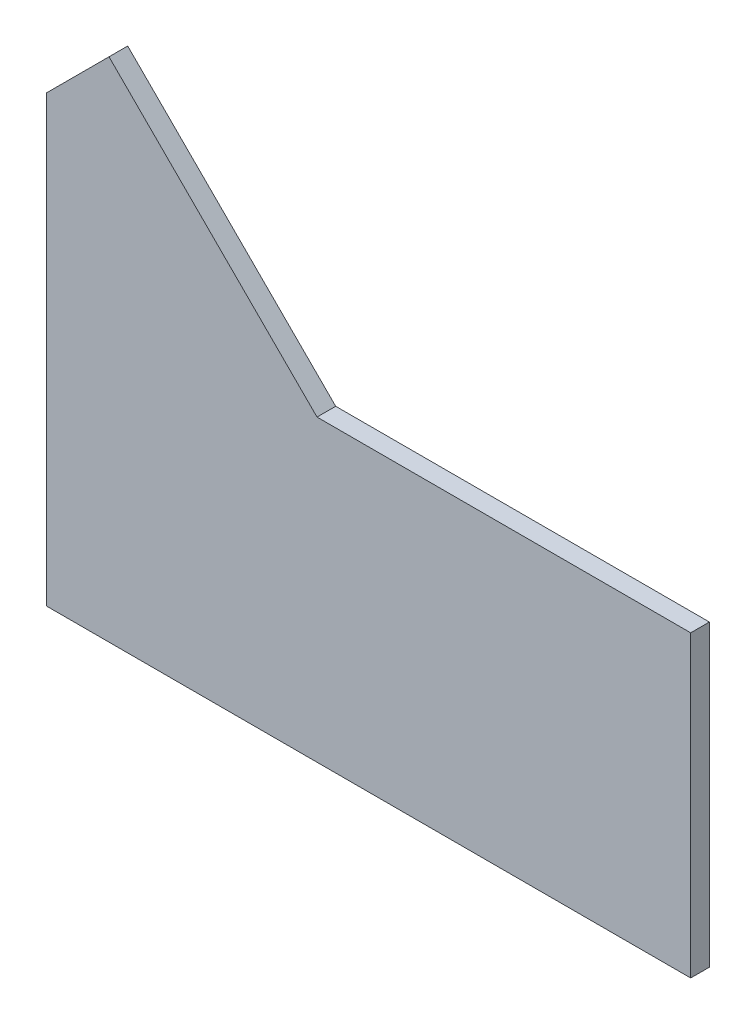
ISO-10303-21;
HEADER;
FILE_DESCRIPTION(('STEP AP214'),'2;1');
FILE_NAME('part.step','',(''),(''),'','','');
FILE_SCHEMA(('AUTOMOTIVE_DESIGN { 1 0 10303 214 1 1 1 1 }'));
ENDSEC;
DATA;
#1=APPLICATION_CONTEXT('core data for automotive mechanical design processes');
#2=APPLICATION_PROTOCOL_DEFINITION('international standard','automotive_design',2000,#1);
#3=PRODUCT_CONTEXT('',#1,'mechanical');
#4=PRODUCT('Part','Part','',(#3));
#5=PRODUCT_RELATED_PRODUCT_CATEGORY('part','',(#4));
#6=PRODUCT_DEFINITION_FORMATION('','',#4);
#7=PRODUCT_DEFINITION_CONTEXT('part definition',#1,'design');
#8=PRODUCT_DEFINITION('design','',#6,#7);
#9=PRODUCT_DEFINITION_SHAPE('','',#8);
#10=(LENGTH_UNIT() NAMED_UNIT(*) SI_UNIT(.MILLI.,.METRE.));
#11=(NAMED_UNIT(*) PLANE_ANGLE_UNIT() SI_UNIT($,.RADIAN.));
#12=(NAMED_UNIT(*) SI_UNIT($,.STERADIAN.) SOLID_ANGLE_UNIT());
#13=UNCERTAINTY_MEASURE_WITH_UNIT(LENGTH_MEASURE(1.E-05),#10,'distance_accuracy_value','');
#14=(GEOMETRIC_REPRESENTATION_CONTEXT(3) GLOBAL_UNCERTAINTY_ASSIGNED_CONTEXT((#13)) GLOBAL_UNIT_ASSIGNED_CONTEXT((#10,
#11,#12)) REPRESENTATION_CONTEXT('',''));
#15=CARTESIAN_POINT('',(0.,0.,0.));
#16=DIRECTION('',(0.,0.,1.));
#17=DIRECTION('',(1.,0.,0.));
#18=AXIS2_PLACEMENT_3D('',#15,#16,#17);
#19=CARTESIAN_POINT('',(0.,0.,6.35));
#20=DIRECTION('',(0.,1.,0.));
#21=DIRECTION('',(-1.,0.,0.));
#22=AXIS2_PLACEMENT_3D('',#19,#20,#21);
#23=PLANE('',#22);
#24=DIRECTION('',(1.,0.,0.));
#25=VECTOR('',#24,1.);
#26=CARTESIAN_POINT('',(0.,0.,0.));
#27=LINE('',#26,#25);
#28=CARTESIAN_POINT('',(-91.8968617926829,0.,0.));
#29=VERTEX_POINT('',#28);
#30=CARTESIAN_POINT('',(127.,0.,0.));
#31=VERTEX_POINT('',#30);
#32=EDGE_CURVE('E82',#29,#31,#27,.T.);
#33=ORIENTED_EDGE('',*,*,#32,.T.);
#34=DIRECTION('',(0.,0.,-1.));
#35=VECTOR('',#34,1.);
#36=CARTESIAN_POINT('',(127.,0.,6.35));
#37=LINE('',#36,#35);
#38=CARTESIAN_POINT('',(127.,0.,6.35));
#39=VERTEX_POINT('',#38);
#40=EDGE_CURVE('E11',#39,#31,#37,.T.);
#41=ORIENTED_EDGE('',*,*,#40,.F.);
#42=DIRECTION('',(1.,0.,0.));
#43=VECTOR('',#42,1.);
#44=CARTESIAN_POINT('',(-91.8968617926829,0.,6.35));
#45=LINE('',#44,#43);
#46=CARTESIAN_POINT('',(-91.8968617926829,0.,6.35));
#47=VERTEX_POINT('',#46);
#48=EDGE_CURVE('E88',#47,#39,#45,.T.);
#49=ORIENTED_EDGE('',*,*,#48,.F.);
#50=DIRECTION('',(0.,0.,-1.));
#51=VECTOR('',#50,1.);
#52=CARTESIAN_POINT('',(-91.8968617926829,0.,6.35));
#53=LINE('',#52,#51);
#54=EDGE_CURVE('E116',#47,#29,#53,.T.);
#55=ORIENTED_EDGE('',*,*,#54,.T.);
#56=EDGE_LOOP('',(#33,#41,#49,#55));
#57=FACE_BOUND('',#56,.T.);
#58=ADVANCED_FACE('F36',(#57),#23,.F.);
#59=CARTESIAN_POINT('',(127.,0.,6.35));
#60=DIRECTION('',(-1.,0.,0.));
#61=DIRECTION('',(0.,0.,1.));
#62=AXIS2_PLACEMENT_3D('',#59,#60,#61);
#63=PLANE('',#62);
#64=DIRECTION('',(0.,1.,0.));
#65=VECTOR('',#64,1.);
#66=CARTESIAN_POINT('',(127.,0.,0.));
#67=LINE('',#66,#65);
#68=CARTESIAN_POINT('',(127.,101.6,0.));
#69=VERTEX_POINT('',#68);
#70=EDGE_CURVE('E121',#31,#69,#67,.T.);
#71=ORIENTED_EDGE('',*,*,#70,.T.);
#72=DIRECTION('',(0.,0.,-1.));
#73=VECTOR('',#72,1.);
#74=CARTESIAN_POINT('',(127.,101.6,6.35));
#75=LINE('',#74,#73);
#76=CARTESIAN_POINT('',(127.,101.6,6.35));
#77=VERTEX_POINT('',#76);
#78=EDGE_CURVE('E44',#77,#69,#75,.T.);
#79=ORIENTED_EDGE('',*,*,#78,.F.);
#80=DIRECTION('',(0.,1.,0.));
#81=VECTOR('',#80,1.);
#82=CARTESIAN_POINT('',(127.,0.,6.35));
#83=LINE('',#82,#81);
#84=EDGE_CURVE('E143',#39,#77,#83,.T.);
#85=ORIENTED_EDGE('',*,*,#84,.F.);
#86=ORIENTED_EDGE('',*,*,#40,.T.);
#87=EDGE_LOOP('',(#71,#79,#85,#86));
#88=FACE_BOUND('',#87,.T.);
#89=ADVANCED_FACE('F146',(#88),#63,.F.);
#90=CARTESIAN_POINT('',(127.,101.6,6.35));
#91=DIRECTION('',(0.,-1.,0.));
#92=DIRECTION('',(1.,0.,0.));
#93=AXIS2_PLACEMENT_3D('',#90,#91,#92);
#94=PLANE('',#93);
#95=DIRECTION('',(-1.,0.,0.));
#96=VECTOR('',#95,1.);
#97=CARTESIAN_POINT('',(127.,101.6,0.));
#98=LINE('',#97,#96);
#99=CARTESIAN_POINT('',(0.,101.6,0.));
#100=VERTEX_POINT('',#99);
#101=EDGE_CURVE('E123',#69,#100,#98,.T.);
#102=ORIENTED_EDGE('',*,*,#101,.T.);
#103=DIRECTION('',(0.,0.,-1.));
#104=VECTOR('',#103,1.);
#105=CARTESIAN_POINT('',(0.,101.6,6.35));
#106=LINE('',#105,#104);
#107=CARTESIAN_POINT('',(0.,101.6,6.35));
#108=VERTEX_POINT('',#107);
#109=EDGE_CURVE('E111',#108,#100,#106,.T.);
#110=ORIENTED_EDGE('',*,*,#109,.F.);
#111=DIRECTION('',(-1.,0.,0.));
#112=VECTOR('',#111,1.);
#113=CARTESIAN_POINT('',(127.,101.6,6.35));
#114=LINE('',#113,#112);
#115=EDGE_CURVE('E102',#77,#108,#114,.T.);
#116=ORIENTED_EDGE('',*,*,#115,.F.);
#117=ORIENTED_EDGE('',*,*,#78,.T.);
#118=EDGE_LOOP('',(#102,#110,#116,#117));
#119=FACE_BOUND('',#118,.T.);
#120=ADVANCED_FACE('F136',(#119),#94,.F.);
#121=CARTESIAN_POINT('',(0.,101.6,6.35));
#122=DIRECTION('',(-0.707106781186544,-0.707106781186551,0.));
#123=DIRECTION('',(0.707106781186551,-0.707106781186544,0.));
#124=AXIS2_PLACEMENT_3D('',#121,#122,#123);
#125=PLANE('',#124);
#126=DIRECTION('',(-0.707106781186551,0.707106781186544,0.));
#127=VECTOR('',#126,1.);
#128=CARTESIAN_POINT('',(0.,101.6,0.));
#129=LINE('',#128,#127);
#130=CARTESIAN_POINT('',(-70.6924277373277,172.292427737327,0.));
#131=VERTEX_POINT('',#130);
#132=EDGE_CURVE('E110',#100,#131,#129,.T.);
#133=ORIENTED_EDGE('',*,*,#132,.T.);
#134=DIRECTION('',(0.,0.,-1.));
#135=VECTOR('',#134,1.);
#136=CARTESIAN_POINT('',(-70.6924277373277,172.292427737327,6.35));
#137=LINE('',#136,#135);
#138=CARTESIAN_POINT('',(-70.6924277373277,172.292427737327,6.35));
#139=VERTEX_POINT('',#138);
#140=EDGE_CURVE('E107',#139,#131,#137,.T.);
#141=ORIENTED_EDGE('',*,*,#140,.F.);
#142=DIRECTION('',(-0.707106781186551,0.707106781186544,0.));
#143=VECTOR('',#142,1.);
#144=CARTESIAN_POINT('',(0.,101.6,6.35));
#145=LINE('',#144,#143);
#146=EDGE_CURVE('E96',#108,#139,#145,.T.);
#147=ORIENTED_EDGE('',*,*,#146,.F.);
#148=ORIENTED_EDGE('',*,*,#109,.T.);
#149=EDGE_LOOP('',(#133,#141,#147,#148));
#150=FACE_BOUND('',#149,.T.);
#151=ADVANCED_FACE('F108',(#150),#125,.F.);
#152=CARTESIAN_POINT('',(-70.6924277373277,172.292427737327,6.35));
#153=DIRECTION('',(0.707106781186551,-0.707106781186543,0.));
#154=DIRECTION('',(0.707106781186544,0.707106781186551,0.));
#155=AXIS2_PLACEMENT_3D('',#152,#153,#154);
#156=PLANE('',#155);
#157=DIRECTION('',(-0.707106781186544,-0.707106781186551,0.));
#158=VECTOR('',#157,1.);
#159=CARTESIAN_POINT('',(-70.6924277373277,172.292427737327,0.));
#160=LINE('',#159,#158);
#161=CARTESIAN_POINT('',(-91.8968617926829,151.087993681972,0.));
#162=VERTEX_POINT('',#161);
#163=EDGE_CURVE('E75',#131,#162,#160,.T.);
#164=ORIENTED_EDGE('',*,*,#163,.T.);
#165=DIRECTION('',(0.,0.,-1.));
#166=VECTOR('',#165,1.);
#167=CARTESIAN_POINT('',(-91.8968617926829,151.087993681972,6.35));
#168=LINE('',#167,#166);
#169=CARTESIAN_POINT('',(-91.8968617926829,151.087993681972,6.35));
#170=VERTEX_POINT('',#169);
#171=EDGE_CURVE('E112',#170,#162,#168,.T.);
#172=ORIENTED_EDGE('',*,*,#171,.F.);
#173=DIRECTION('',(-0.707106781186544,-0.707106781186551,0.));
#174=VECTOR('',#173,1.);
#175=CARTESIAN_POINT('',(-70.6924277373277,172.292427737327,6.35));
#176=LINE('',#175,#174);
#177=EDGE_CURVE('E100',#139,#170,#176,.T.);
#178=ORIENTED_EDGE('',*,*,#177,.F.);
#179=ORIENTED_EDGE('',*,*,#140,.T.);
#180=EDGE_LOOP('',(#164,#172,#178,#179));
#181=FACE_BOUND('',#180,.T.);
#182=ADVANCED_FACE('F114',(#181),#156,.F.);
#183=CARTESIAN_POINT('',(-91.8968617926829,151.087993681972,6.35));
#184=DIRECTION('',(1.,0.,0.));
#185=DIRECTION('',(0.,0.,-1.));
#186=AXIS2_PLACEMENT_3D('',#183,#184,#185);
#187=PLANE('',#186);
#188=DIRECTION('',(0.,-1.,0.));
#189=VECTOR('',#188,1.);
#190=CARTESIAN_POINT('',(-91.8968617926829,151.087993681972,0.));
#191=LINE('',#190,#189);
#192=EDGE_CURVE('E127',#162,#29,#191,.T.);
#193=ORIENTED_EDGE('',*,*,#192,.T.);
#194=ORIENTED_EDGE('',*,*,#54,.F.);
#195=DIRECTION('',(0.,-1.,0.));
#196=VECTOR('',#195,1.);
#197=CARTESIAN_POINT('',(-91.8968617926829,151.087993681972,6.35));
#198=LINE('',#197,#196);
#199=EDGE_CURVE('E52',#170,#47,#198,.T.);
#200=ORIENTED_EDGE('',*,*,#199,.F.);
#201=ORIENTED_EDGE('',*,*,#171,.T.);
#202=EDGE_LOOP('',(#193,#194,#200,#201));
#203=FACE_BOUND('',#202,.T.);
#204=ADVANCED_FACE('F141',(#203),#187,.F.);
#205=CARTESIAN_POINT('',(0.,0.,6.35));
#206=DIRECTION('',(0.,0.,1.));
#207=DIRECTION('',(1.,0.,0.));
#208=AXIS2_PLACEMENT_3D('',#205,#206,#207);
#209=PLANE('',#208);
#210=ORIENTED_EDGE('',*,*,#48,.T.);
#211=ORIENTED_EDGE('',*,*,#84,.T.);
#212=ORIENTED_EDGE('',*,*,#115,.T.);
#213=ORIENTED_EDGE('',*,*,#146,.T.);
#214=ORIENTED_EDGE('',*,*,#177,.T.);
#215=ORIENTED_EDGE('',*,*,#199,.T.);
#216=EDGE_LOOP('',(#210,#211,#212,#213,#214,#215));
#217=FACE_BOUND('',#216,.T.);
#218=ADVANCED_FACE('F98',(#217),#209,.T.);
#219=CARTESIAN_POINT('',(0.,0.,0.));
#220=DIRECTION('',(0.,0.,1.));
#221=DIRECTION('',(1.,0.,0.));
#222=AXIS2_PLACEMENT_3D('',#219,#220,#221);
#223=PLANE('',#222);
#224=ORIENTED_EDGE('',*,*,#32,.F.);
#225=ORIENTED_EDGE('',*,*,#192,.F.);
#226=ORIENTED_EDGE('',*,*,#163,.F.);
#227=ORIENTED_EDGE('',*,*,#132,.F.);
#228=ORIENTED_EDGE('',*,*,#101,.F.);
#229=ORIENTED_EDGE('',*,*,#70,.F.);
#230=EDGE_LOOP('',(#224,#225,#226,#227,#228,#229));
#231=FACE_BOUND('',#230,.T.);
#232=ADVANCED_FACE('F139',(#231),#223,.F.);
#233=CLOSED_SHELL('',(#58,#89,#120,#151,#182,#204,#218,#232));
#234=MANIFOLD_SOLID_BREP('B2',#233);
#235=ADVANCED_BREP_SHAPE_REPRESENTATION('',(#18,#234),#14);
#236=SHAPE_DEFINITION_REPRESENTATION(#9,#235);
ENDSEC;
END-ISO-10303-21;
